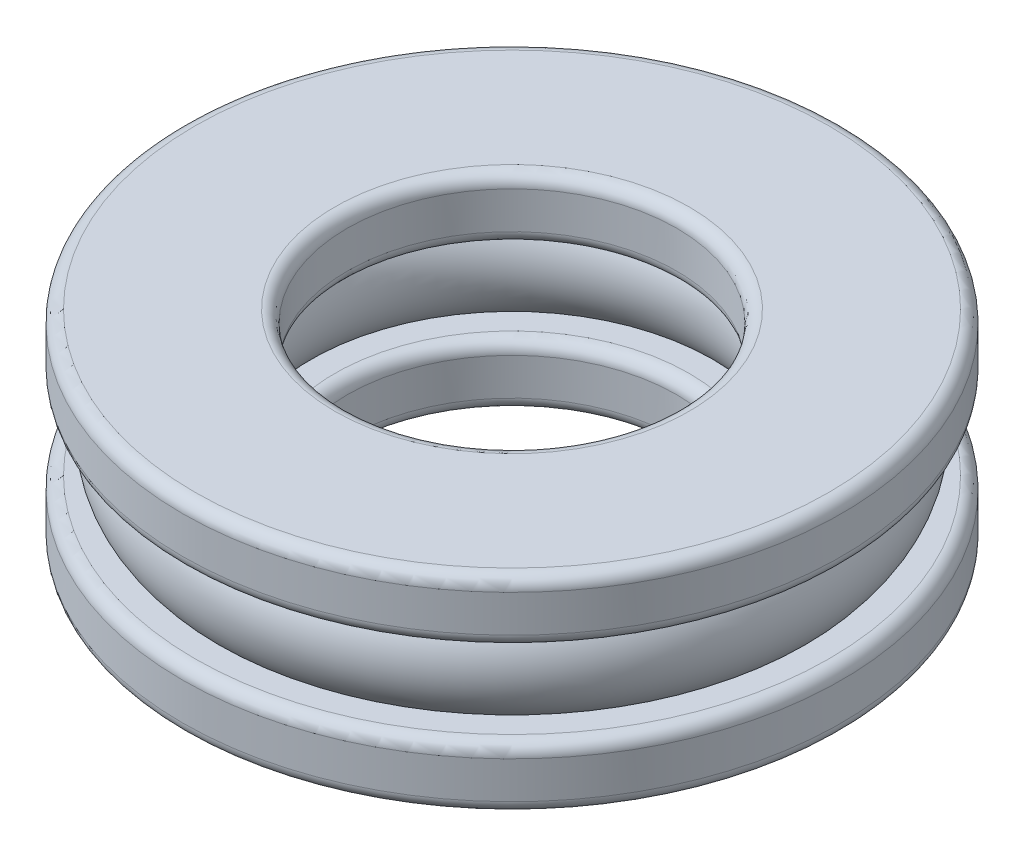
ISO-10303-21;
HEADER;
FILE_DESCRIPTION(('STEP AP214'),'2;1');
FILE_NAME('part.step','',(''),(''),'','','');
FILE_SCHEMA(('AUTOMOTIVE_DESIGN { 1 0 10303 214 1 1 1 1 }'));
ENDSEC;
DATA;
#1=APPLICATION_CONTEXT('core data for automotive mechanical design processes');
#2=APPLICATION_PROTOCOL_DEFINITION('international standard','automotive_design',2000,#1);
#3=PRODUCT_CONTEXT('',#1,'mechanical');
#4=PRODUCT('Part','Part','',(#3));
#5=PRODUCT_RELATED_PRODUCT_CATEGORY('part','',(#4));
#6=PRODUCT_DEFINITION_FORMATION('','',#4);
#7=PRODUCT_DEFINITION_CONTEXT('part definition',#1,'design');
#8=PRODUCT_DEFINITION('design','',#6,#7);
#9=PRODUCT_DEFINITION_SHAPE('','',#8);
#10=(LENGTH_UNIT() NAMED_UNIT(*) SI_UNIT(.MILLI.,.METRE.));
#11=(NAMED_UNIT(*) PLANE_ANGLE_UNIT() SI_UNIT($,.RADIAN.));
#12=(NAMED_UNIT(*) SI_UNIT($,.STERADIAN.) SOLID_ANGLE_UNIT());
#13=UNCERTAINTY_MEASURE_WITH_UNIT(LENGTH_MEASURE(1.E-05),#10,'distance_accuracy_value','');
#14=(GEOMETRIC_REPRESENTATION_CONTEXT(3) GLOBAL_UNCERTAINTY_ASSIGNED_CONTEXT((#13)) GLOBAL_UNIT_ASSIGNED_CONTEXT((#10,
#11,#12)) REPRESENTATION_CONTEXT('',''));
#15=CARTESIAN_POINT('',(0.,0.,0.));
#16=DIRECTION('',(0.,0.,1.));
#17=DIRECTION('',(1.,0.,0.));
#18=AXIS2_PLACEMENT_3D('',#15,#16,#17);
#19=CARTESIAN_POINT('',(0.,6.96703296703297,0.));
#20=DIRECTION('',(0.,1.,0.));
#21=DIRECTION('',(0.,0.,1.));
#22=AXIS2_PLACEMENT_3D('',#19,#20,#21);
#23=CYLINDRICAL_SURFACE('',#22,4.);
#24=CARTESIAN_POINT('',(0.,1.2,0.));
#25=DIRECTION('',(0.,-1.,0.));
#26=DIRECTION('',(0.,0.,-1.));
#27=AXIS2_PLACEMENT_3D('',#24,#25,#26);
#28=CIRCLE('',#27,4.);
#29=CARTESIAN_POINT('',(0.,1.2,-4.));
#30=VERTEX_POINT('',#29);
#31=EDGE_CURVE('E82',#30,#30,#28,.F.);
#32=ORIENTED_EDGE('',*,*,#31,.T.);
#33=EDGE_LOOP('',(#32));
#34=FACE_BOUND('',#33,.T.);
#35=CARTESIAN_POINT('',(0.,0.3,0.));
#36=DIRECTION('',(0.,1.,0.));
#37=DIRECTION('',(0.,0.,1.));
#38=AXIS2_PLACEMENT_3D('',#35,#36,#37);
#39=CIRCLE('',#38,4.);
#40=CARTESIAN_POINT('',(0.,0.3,4.));
#41=VERTEX_POINT('',#40);
#42=EDGE_CURVE('E85',#41,#41,#39,.F.);
#43=ORIENTED_EDGE('',*,*,#42,.T.);
#44=EDGE_LOOP('',(#43));
#45=FACE_BOUND('',#44,.T.);
#46=ADVANCED_FACE('F32',(#34,#45),#23,.F.);
#47=CARTESIAN_POINT('',(4.,0.,0.));
#48=DIRECTION('',(0.,1.,0.));
#49=DIRECTION('',(0.,0.,1.));
#50=AXIS2_PLACEMENT_3D('',#47,#48,#49);
#51=PLANE('',#50);
#52=CARTESIAN_POINT('',(0.,0.,0.));
#53=DIRECTION('',(0.,1.,0.));
#54=DIRECTION('',(0.,0.,1.));
#55=AXIS2_PLACEMENT_3D('',#52,#53,#54);
#56=CIRCLE('',#55,4.3);
#57=CARTESIAN_POINT('',(0.,0.,4.3));
#58=VERTEX_POINT('',#57);
#59=EDGE_CURVE('E43',#58,#58,#56,.T.);
#60=ORIENTED_EDGE('',*,*,#59,.T.);
#61=EDGE_LOOP('',(#60));
#62=FACE_BOUND('',#61,.T.);
#63=CARTESIAN_POINT('',(0.,0.,0.));
#64=DIRECTION('',(0.,1.,0.));
#65=DIRECTION('',(0.,0.,1.));
#66=AXIS2_PLACEMENT_3D('',#63,#64,#65);
#67=CIRCLE('',#66,7.7);
#68=CARTESIAN_POINT('',(0.,0.,7.7));
#69=VERTEX_POINT('',#68);
#70=EDGE_CURVE('E47',#69,#69,#67,.F.);
#71=ORIENTED_EDGE('',*,*,#70,.T.);
#72=EDGE_LOOP('',(#71));
#73=FACE_BOUND('',#72,.T.);
#74=ADVANCED_FACE('F121',(#62,#73),#51,.F.);
#75=CARTESIAN_POINT('',(0.,6.96703296703297,0.));
#76=DIRECTION('',(0.,1.,0.));
#77=DIRECTION('',(0.,0.,1.));
#78=AXIS2_PLACEMENT_3D('',#75,#76,#77);
#79=CYLINDRICAL_SURFACE('',#78,8.);
#80=CARTESIAN_POINT('',(0.,1.2,0.));
#81=DIRECTION('',(0.,-1.,0.));
#82=DIRECTION('',(0.,0.,-1.));
#83=AXIS2_PLACEMENT_3D('',#80,#81,#82);
#84=CIRCLE('',#83,8.);
#85=CARTESIAN_POINT('',(0.,1.2,-8.));
#86=VERTEX_POINT('',#85);
#87=EDGE_CURVE('E61',#86,#86,#84,.T.);
#88=ORIENTED_EDGE('',*,*,#87,.T.);
#89=EDGE_LOOP('',(#88));
#90=FACE_BOUND('',#89,.T.);
#91=CARTESIAN_POINT('',(0.,0.3,0.));
#92=DIRECTION('',(0.,1.,0.));
#93=DIRECTION('',(0.,0.,1.));
#94=AXIS2_PLACEMENT_3D('',#91,#92,#93);
#95=CIRCLE('',#94,8.);
#96=CARTESIAN_POINT('',(0.,0.3,8.));
#97=VERTEX_POINT('',#96);
#98=EDGE_CURVE('E64',#97,#97,#95,.T.);
#99=ORIENTED_EDGE('',*,*,#98,.T.);
#100=EDGE_LOOP('',(#99));
#101=FACE_BOUND('',#100,.T.);
#102=ADVANCED_FACE('F127',(#90,#101),#79,.T.);
#103=CARTESIAN_POINT('',(8.,1.5,0.));
#104=DIRECTION('',(0.,-1.,0.));
#105=DIRECTION('',(0.,0.,-1.));
#106=AXIS2_PLACEMENT_3D('',#103,#104,#105);
#107=PLANE('',#106);
#108=CARTESIAN_POINT('',(0.,1.5,0.));
#109=DIRECTION('',(0.,-1.,0.));
#110=DIRECTION('',(0.,0.,-1.));
#111=AXIS2_PLACEMENT_3D('',#108,#109,#110);
#112=CIRCLE('',#111,7.7);
#113=CARTESIAN_POINT('',(0.,1.5,-7.7));
#114=VERTEX_POINT('',#113);
#115=EDGE_CURVE('E67',#114,#114,#112,.F.);
#116=ORIENTED_EDGE('',*,*,#115,.T.);
#117=EDGE_LOOP('',(#116));
#118=FACE_BOUND('',#117,.T.);
#119=CARTESIAN_POINT('',(0.,1.5,0.));
#120=DIRECTION('',(0.,1.,0.));
#121=DIRECTION('',(0.,0.,1.));
#122=AXIS2_PLACEMENT_3D('',#119,#120,#121);
#123=CIRCLE('',#122,7.11803398874989);
#124=CARTESIAN_POINT('',(0.,1.5,7.11803398874989));
#125=VERTEX_POINT('',#124);
#126=EDGE_CURVE('E88',#125,#125,#123,.T.);
#127=ORIENTED_EDGE('',*,*,#126,.F.);
#128=EDGE_LOOP('',(#127));
#129=FACE_BOUND('',#128,.T.);
#130=ADVANCED_FACE('F187',(#118,#129),#107,.F.);
#131=CARTESIAN_POINT('',(0.,2.5,0.));
#132=DIRECTION('',(0.,1.,0.));
#133=DIRECTION('',(0.,0.,1.));
#134=AXIS2_PLACEMENT_3D('',#131,#132,#133);
#135=TOROIDAL_SURFACE('',#134,6.,1.5);
#136=CARTESIAN_POINT('',(0.,3.5,0.));
#137=DIRECTION('',(0.,1.,0.));
#138=DIRECTION('',(0.,0.,1.));
#139=AXIS2_PLACEMENT_3D('',#136,#137,#138);
#140=CIRCLE('',#139,7.11803398874989);
#141=CARTESIAN_POINT('',(0.,3.5,7.11803398874989));
#142=VERTEX_POINT('',#141);
#143=EDGE_CURVE('E91',#142,#142,#140,.T.);
#144=ORIENTED_EDGE('',*,*,#143,.F.);
#145=EDGE_LOOP('',(#144));
#146=FACE_BOUND('',#145,.T.);
#147=ORIENTED_EDGE('',*,*,#126,.T.);
#148=EDGE_LOOP('',(#147));
#149=FACE_BOUND('',#148,.T.);
#150=ADVANCED_FACE('F181',(#146,#149),#135,.T.);
#151=CARTESIAN_POINT('',(8.,3.5,0.));
#152=DIRECTION('',(0.,1.,0.));
#153=DIRECTION('',(0.,0.,1.));
#154=AXIS2_PLACEMENT_3D('',#151,#152,#153);
#155=PLANE('',#154);
#156=CARTESIAN_POINT('',(0.,3.5,0.));
#157=DIRECTION('',(0.,1.,0.));
#158=DIRECTION('',(0.,0.,1.));
#159=AXIS2_PLACEMENT_3D('',#156,#157,#158);
#160=CIRCLE('',#159,7.7);
#161=CARTESIAN_POINT('',(0.,3.5,7.7));
#162=VERTEX_POINT('',#161);
#163=EDGE_CURVE('E52',#162,#162,#160,.F.);
#164=ORIENTED_EDGE('',*,*,#163,.T.);
#165=EDGE_LOOP('',(#164));
#166=FACE_BOUND('',#165,.T.);
#167=ORIENTED_EDGE('',*,*,#143,.T.);
#168=EDGE_LOOP('',(#167));
#169=FACE_BOUND('',#168,.T.);
#170=ADVANCED_FACE('F173',(#166,#169),#155,.F.);
#171=CARTESIAN_POINT('',(0.,6.96703296703297,0.));
#172=DIRECTION('',(0.,1.,0.));
#173=DIRECTION('',(0.,0.,1.));
#174=AXIS2_PLACEMENT_3D('',#171,#172,#173);
#175=CYLINDRICAL_SURFACE('',#174,8.);
#176=CARTESIAN_POINT('',(0.,3.8,0.));
#177=DIRECTION('',(0.,1.,0.));
#178=DIRECTION('',(0.,0.,1.));
#179=AXIS2_PLACEMENT_3D('',#176,#177,#178);
#180=CIRCLE('',#179,8.);
#181=CARTESIAN_POINT('',(0.,3.8,8.));
#182=VERTEX_POINT('',#181);
#183=EDGE_CURVE('E55',#182,#182,#180,.T.);
#184=ORIENTED_EDGE('',*,*,#183,.T.);
#185=EDGE_LOOP('',(#184));
#186=FACE_BOUND('',#185,.T.);
#187=CARTESIAN_POINT('',(0.,4.7,0.));
#188=DIRECTION('',(0.,-1.,0.));
#189=DIRECTION('',(0.,0.,-1.));
#190=AXIS2_PLACEMENT_3D('',#187,#188,#189);
#191=CIRCLE('',#190,8.);
#192=CARTESIAN_POINT('',(0.,4.7,-8.));
#193=VERTEX_POINT('',#192);
#194=EDGE_CURVE('E58',#193,#193,#191,.T.);
#195=ORIENTED_EDGE('',*,*,#194,.T.);
#196=EDGE_LOOP('',(#195));
#197=FACE_BOUND('',#196,.T.);
#198=ADVANCED_FACE('F171',(#186,#197),#175,.T.);
#199=CARTESIAN_POINT('',(4.,5.,0.));
#200=DIRECTION('',(0.,-1.,0.));
#201=DIRECTION('',(0.,0.,-1.));
#202=AXIS2_PLACEMENT_3D('',#199,#200,#201);
#203=PLANE('',#202);
#204=CARTESIAN_POINT('',(0.,5.,0.));
#205=DIRECTION('',(0.,-1.,0.));
#206=DIRECTION('',(0.,0.,-1.));
#207=AXIS2_PLACEMENT_3D('',#204,#205,#206);
#208=CIRCLE('',#207,4.3);
#209=CARTESIAN_POINT('',(0.,5.,-4.3));
#210=VERTEX_POINT('',#209);
#211=EDGE_CURVE('E10',#210,#210,#208,.T.);
#212=ORIENTED_EDGE('',*,*,#211,.T.);
#213=EDGE_LOOP('',(#212));
#214=FACE_BOUND('',#213,.T.);
#215=CARTESIAN_POINT('',(0.,5.,0.));
#216=DIRECTION('',(0.,-1.,0.));
#217=DIRECTION('',(0.,0.,-1.));
#218=AXIS2_PLACEMENT_3D('',#215,#216,#217);
#219=CIRCLE('',#218,7.7);
#220=CARTESIAN_POINT('',(0.,5.,-7.7));
#221=VERTEX_POINT('',#220);
#222=EDGE_CURVE('E39',#221,#221,#219,.F.);
#223=ORIENTED_EDGE('',*,*,#222,.T.);
#224=EDGE_LOOP('',(#223));
#225=FACE_BOUND('',#224,.T.);
#226=ADVANCED_FACE('F117',(#214,#225),#203,.F.);
#227=CARTESIAN_POINT('',(0.,6.96703296703297,0.));
#228=DIRECTION('',(0.,1.,0.));
#229=DIRECTION('',(0.,0.,1.));
#230=AXIS2_PLACEMENT_3D('',#227,#228,#229);
#231=CYLINDRICAL_SURFACE('',#230,4.);
#232=CARTESIAN_POINT('',(0.,3.8,0.));
#233=DIRECTION('',(0.,1.,0.));
#234=DIRECTION('',(0.,0.,1.));
#235=AXIS2_PLACEMENT_3D('',#232,#233,#234);
#236=CIRCLE('',#235,4.);
#237=CARTESIAN_POINT('',(0.,3.8,4.));
#238=VERTEX_POINT('',#237);
#239=EDGE_CURVE('E70',#238,#238,#236,.F.);
#240=ORIENTED_EDGE('',*,*,#239,.T.);
#241=EDGE_LOOP('',(#240));
#242=FACE_BOUND('',#241,.T.);
#243=CARTESIAN_POINT('',(0.,4.7,0.));
#244=DIRECTION('',(0.,-1.,0.));
#245=DIRECTION('',(0.,0.,-1.));
#246=AXIS2_PLACEMENT_3D('',#243,#244,#245);
#247=CIRCLE('',#246,4.);
#248=CARTESIAN_POINT('',(0.,4.7,-4.));
#249=VERTEX_POINT('',#248);
#250=EDGE_CURVE('E73',#249,#249,#247,.F.);
#251=ORIENTED_EDGE('',*,*,#250,.T.);
#252=EDGE_LOOP('',(#251));
#253=FACE_BOUND('',#252,.T.);
#254=ADVANCED_FACE('F111',(#242,#253),#231,.F.);
#255=CARTESIAN_POINT('',(4.88196601125011,3.5,0.));
#256=DIRECTION('',(0.,1.,0.));
#257=DIRECTION('',(0.,0.,1.));
#258=AXIS2_PLACEMENT_3D('',#255,#256,#257);
#259=PLANE('',#258);
#260=CARTESIAN_POINT('',(0.,3.5,0.));
#261=DIRECTION('',(0.,1.,0.));
#262=DIRECTION('',(0.,0.,1.));
#263=AXIS2_PLACEMENT_3D('',#260,#261,#262);
#264=CIRCLE('',#263,4.3);
#265=CARTESIAN_POINT('',(0.,3.5,4.3));
#266=VERTEX_POINT('',#265);
#267=EDGE_CURVE('E76',#266,#266,#264,.T.);
#268=ORIENTED_EDGE('',*,*,#267,.T.);
#269=EDGE_LOOP('',(#268));
#270=FACE_BOUND('',#269,.T.);
#271=CARTESIAN_POINT('',(0.,3.5,0.));
#272=DIRECTION('',(0.,1.,0.));
#273=DIRECTION('',(0.,0.,1.));
#274=AXIS2_PLACEMENT_3D('',#271,#272,#273);
#275=CIRCLE('',#274,4.88196601125011);
#276=CARTESIAN_POINT('',(0.,3.5,4.88196601125011));
#277=VERTEX_POINT('',#276);
#278=EDGE_CURVE('E94',#277,#277,#275,.T.);
#279=ORIENTED_EDGE('',*,*,#278,.F.);
#280=EDGE_LOOP('',(#279));
#281=FACE_BOUND('',#280,.T.);
#282=ADVANCED_FACE('F106',(#270,#281),#259,.F.);
#283=CARTESIAN_POINT('',(0.,2.5,0.));
#284=DIRECTION('',(0.,1.,0.));
#285=DIRECTION('',(0.,0.,1.));
#286=AXIS2_PLACEMENT_3D('',#283,#284,#285);
#287=TOROIDAL_SURFACE('',#286,6.,1.5);
#288=CARTESIAN_POINT('',(0.,1.5,0.));
#289=DIRECTION('',(0.,1.,0.));
#290=DIRECTION('',(0.,0.,1.));
#291=AXIS2_PLACEMENT_3D('',#288,#289,#290);
#292=CIRCLE('',#291,4.88196601125011);
#293=CARTESIAN_POINT('',(0.,1.5,4.88196601125011));
#294=VERTEX_POINT('',#293);
#295=EDGE_CURVE('E97',#294,#294,#292,.T.);
#296=ORIENTED_EDGE('',*,*,#295,.F.);
#297=EDGE_LOOP('',(#296));
#298=FACE_BOUND('',#297,.T.);
#299=ORIENTED_EDGE('',*,*,#278,.T.);
#300=EDGE_LOOP('',(#299));
#301=FACE_BOUND('',#300,.T.);
#302=ADVANCED_FACE('F103',(#298,#301),#287,.T.);
#303=CARTESIAN_POINT('',(4.88196601125011,1.5,0.));
#304=DIRECTION('',(0.,-1.,0.));
#305=DIRECTION('',(0.,0.,-1.));
#306=AXIS2_PLACEMENT_3D('',#303,#304,#305);
#307=PLANE('',#306);
#308=CARTESIAN_POINT('',(0.,1.5,0.));
#309=DIRECTION('',(0.,-1.,0.));
#310=DIRECTION('',(0.,0.,-1.));
#311=AXIS2_PLACEMENT_3D('',#308,#309,#310);
#312=CIRCLE('',#311,4.3);
#313=CARTESIAN_POINT('',(0.,1.5,-4.3));
#314=VERTEX_POINT('',#313);
#315=EDGE_CURVE('E79',#314,#314,#312,.T.);
#316=ORIENTED_EDGE('',*,*,#315,.T.);
#317=EDGE_LOOP('',(#316));
#318=FACE_BOUND('',#317,.T.);
#319=ORIENTED_EDGE('',*,*,#295,.T.);
#320=EDGE_LOOP('',(#319));
#321=FACE_BOUND('',#320,.T.);
#322=ADVANCED_FACE('F101',(#318,#321),#307,.F.);
#323=CARTESIAN_POINT('',(0.,1.2,0.));
#324=DIRECTION('',(0.,-1.,0.));
#325=DIRECTION('',(0.,0.,-1.));
#326=AXIS2_PLACEMENT_3D('',#323,#324,#325);
#327=TOROIDAL_SURFACE('',#326,4.3,0.3);
#328=ORIENTED_EDGE('',*,*,#315,.F.);
#329=EDGE_LOOP('',(#328));
#330=FACE_BOUND('',#329,.T.);
#331=ORIENTED_EDGE('',*,*,#31,.F.);
#332=EDGE_LOOP('',(#331));
#333=FACE_BOUND('',#332,.T.);
#334=ADVANCED_FACE('F133',(#330,#333),#327,.T.);
#335=CARTESIAN_POINT('',(0.,3.8,0.));
#336=DIRECTION('',(0.,1.,0.));
#337=DIRECTION('',(0.,0.,1.));
#338=AXIS2_PLACEMENT_3D('',#335,#336,#337);
#339=TOROIDAL_SURFACE('',#338,4.3,0.3);
#340=ORIENTED_EDGE('',*,*,#239,.F.);
#341=EDGE_LOOP('',(#340));
#342=FACE_BOUND('',#341,.T.);
#343=ORIENTED_EDGE('',*,*,#267,.F.);
#344=EDGE_LOOP('',(#343));
#345=FACE_BOUND('',#344,.T.);
#346=ADVANCED_FACE('F136',(#342,#345),#339,.T.);
#347=CARTESIAN_POINT('',(0.,1.2,0.));
#348=DIRECTION('',(0.,-1.,0.));
#349=DIRECTION('',(0.,0.,-1.));
#350=AXIS2_PLACEMENT_3D('',#347,#348,#349);
#351=TOROIDAL_SURFACE('',#350,7.7,0.3);
#352=ORIENTED_EDGE('',*,*,#87,.F.);
#353=EDGE_LOOP('',(#352));
#354=FACE_BOUND('',#353,.T.);
#355=ORIENTED_EDGE('',*,*,#115,.F.);
#356=EDGE_LOOP('',(#355));
#357=FACE_BOUND('',#356,.T.);
#358=ADVANCED_FACE('F140',(#354,#357),#351,.T.);
#359=CARTESIAN_POINT('',(0.,3.8,0.));
#360=DIRECTION('',(0.,1.,0.));
#361=DIRECTION('',(0.,0.,1.));
#362=AXIS2_PLACEMENT_3D('',#359,#360,#361);
#363=TOROIDAL_SURFACE('',#362,7.7,0.3);
#364=ORIENTED_EDGE('',*,*,#163,.F.);
#365=EDGE_LOOP('',(#364));
#366=FACE_BOUND('',#365,.T.);
#367=ORIENTED_EDGE('',*,*,#183,.F.);
#368=EDGE_LOOP('',(#367));
#369=FACE_BOUND('',#368,.T.);
#370=ADVANCED_FACE('F144',(#366,#369),#363,.T.);
#371=CARTESIAN_POINT('',(0.,0.3,0.));
#372=DIRECTION('',(0.,1.,0.));
#373=DIRECTION('',(0.,0.,1.));
#374=AXIS2_PLACEMENT_3D('',#371,#372,#373);
#375=TOROIDAL_SURFACE('',#374,4.3,0.3);
#376=ORIENTED_EDGE('',*,*,#42,.F.);
#377=EDGE_LOOP('',(#376));
#378=FACE_BOUND('',#377,.T.);
#379=ORIENTED_EDGE('',*,*,#59,.F.);
#380=EDGE_LOOP('',(#379));
#381=FACE_BOUND('',#380,.T.);
#382=ADVANCED_FACE('F148',(#378,#381),#375,.T.);
#383=CARTESIAN_POINT('',(0.,0.3,0.));
#384=DIRECTION('',(0.,1.,0.));
#385=DIRECTION('',(0.,0.,1.));
#386=AXIS2_PLACEMENT_3D('',#383,#384,#385);
#387=TOROIDAL_SURFACE('',#386,7.7,0.3);
#388=ORIENTED_EDGE('',*,*,#70,.F.);
#389=EDGE_LOOP('',(#388));
#390=FACE_BOUND('',#389,.T.);
#391=ORIENTED_EDGE('',*,*,#98,.F.);
#392=EDGE_LOOP('',(#391));
#393=FACE_BOUND('',#392,.T.);
#394=ADVANCED_FACE('F152',(#390,#393),#387,.T.);
#395=CARTESIAN_POINT('',(0.,4.7,0.));
#396=DIRECTION('',(0.,-1.,0.));
#397=DIRECTION('',(0.,0.,-1.));
#398=AXIS2_PLACEMENT_3D('',#395,#396,#397);
#399=TOROIDAL_SURFACE('',#398,4.3,0.3);
#400=ORIENTED_EDGE('',*,*,#211,.F.);
#401=EDGE_LOOP('',(#400));
#402=FACE_BOUND('',#401,.T.);
#403=ORIENTED_EDGE('',*,*,#250,.F.);
#404=EDGE_LOOP('',(#403));
#405=FACE_BOUND('',#404,.T.);
#406=ADVANCED_FACE('F155',(#402,#405),#399,.T.);
#407=CARTESIAN_POINT('',(0.,4.7,0.));
#408=DIRECTION('',(0.,-1.,0.));
#409=DIRECTION('',(0.,0.,-1.));
#410=AXIS2_PLACEMENT_3D('',#407,#408,#409);
#411=TOROIDAL_SURFACE('',#410,7.7,0.3);
#412=ORIENTED_EDGE('',*,*,#194,.F.);
#413=EDGE_LOOP('',(#412));
#414=FACE_BOUND('',#413,.T.);
#415=ORIENTED_EDGE('',*,*,#222,.F.);
#416=EDGE_LOOP('',(#415));
#417=FACE_BOUND('',#416,.T.);
#418=ADVANCED_FACE('F34',(#414,#417),#411,.T.);
#419=CLOSED_SHELL('',(#46,#74,#102,#130,#150,#170,#198,#226,#254,#282,#302,#322,#334,#346,#358,
#370,#382,#394,#406,#418));
#420=MANIFOLD_SOLID_BREP('B2',#419);
#421=ADVANCED_BREP_SHAPE_REPRESENTATION('',(#18,#420),#14);
#422=SHAPE_DEFINITION_REPRESENTATION(#9,#421);
ENDSEC;
END-ISO-10303-21;
